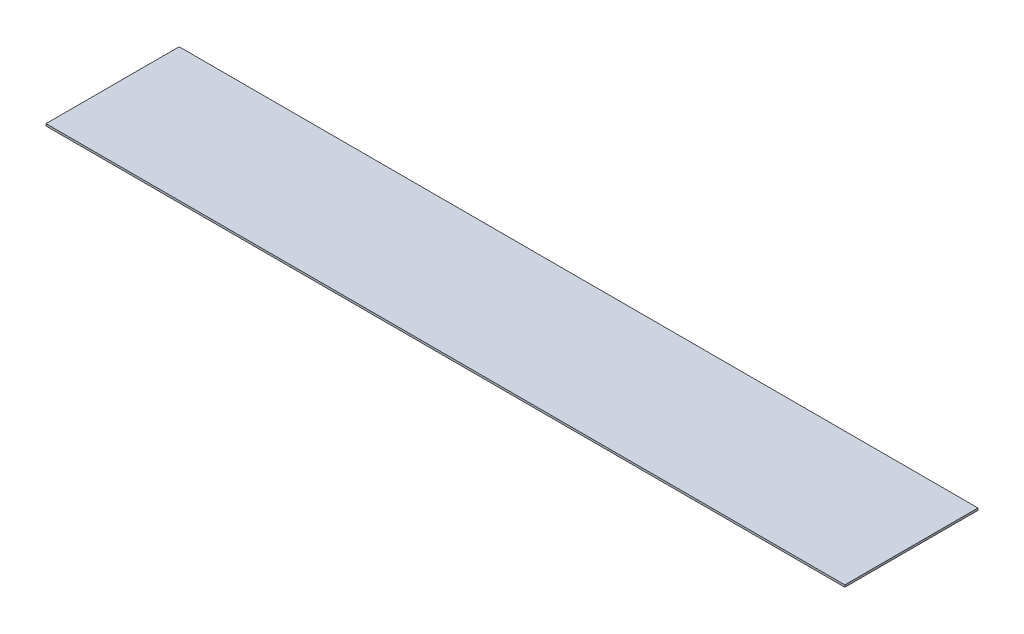
ISO-10303-21;
HEADER;
FILE_DESCRIPTION(('STEP AP214'),'2;1');
FILE_NAME('part.step','',(''),(''),'','','');
FILE_SCHEMA(('AUTOMOTIVE_DESIGN { 1 0 10303 214 1 1 1 1 }'));
ENDSEC;
DATA;
#1=APPLICATION_CONTEXT('core data for automotive mechanical design processes');
#2=APPLICATION_PROTOCOL_DEFINITION('international standard','automotive_design',2000,#1);
#3=PRODUCT_CONTEXT('',#1,'mechanical');
#4=PRODUCT('Part','Part','',(#3));
#5=PRODUCT_RELATED_PRODUCT_CATEGORY('part','',(#4));
#6=PRODUCT_DEFINITION_FORMATION('','',#4);
#7=PRODUCT_DEFINITION_CONTEXT('part definition',#1,'design');
#8=PRODUCT_DEFINITION('design','',#6,#7);
#9=PRODUCT_DEFINITION_SHAPE('','',#8);
#10=(LENGTH_UNIT() NAMED_UNIT(*) SI_UNIT(.MILLI.,.METRE.));
#11=(NAMED_UNIT(*) PLANE_ANGLE_UNIT() SI_UNIT($,.RADIAN.));
#12=(NAMED_UNIT(*) SI_UNIT($,.STERADIAN.) SOLID_ANGLE_UNIT());
#13=UNCERTAINTY_MEASURE_WITH_UNIT(LENGTH_MEASURE(1.E-05),#10,'distance_accuracy_value','');
#14=(GEOMETRIC_REPRESENTATION_CONTEXT(3) GLOBAL_UNCERTAINTY_ASSIGNED_CONTEXT((#13)) GLOBAL_UNIT_ASSIGNED_CONTEXT((#10,
#11,#12)) REPRESENTATION_CONTEXT('',''));
#15=CARTESIAN_POINT('',(0.,0.,0.));
#16=DIRECTION('',(0.,0.,1.));
#17=DIRECTION('',(1.,0.,0.));
#18=AXIS2_PLACEMENT_3D('',#15,#16,#17);
#19=CARTESIAN_POINT('',(0.,-81.849866020411,0.));
#20=DIRECTION('',(1.,0.,0.));
#21=DIRECTION('',(0.,0.,-1.));
#22=AXIS2_PLACEMENT_3D('',#19,#20,#21);
#23=PLANE('',#22);
#24=DIRECTION('',(0.,0.,-1.));
#25=VECTOR('',#24,1.);
#26=CARTESIAN_POINT('',(0.,-80.262366020411,0.));
#27=LINE('',#26,#25);
#28=CARTESIAN_POINT('',(0.,-80.262366020411,101.6));
#29=VERTEX_POINT('',#28);
#30=CARTESIAN_POINT('',(0.,-80.262366020411,0.));
#31=VERTEX_POINT('',#30);
#32=EDGE_CURVE('E99',#29,#31,#27,.T.);
#33=ORIENTED_EDGE('',*,*,#32,.T.);
#34=DIRECTION('',(0.,1.,0.));
#35=VECTOR('',#34,1.);
#36=CARTESIAN_POINT('',(0.,-81.849866020411,0.));
#37=LINE('',#36,#35);
#38=CARTESIAN_POINT('',(0.,-81.849866020411,0.));
#39=VERTEX_POINT('',#38);
#40=EDGE_CURVE('E11',#39,#31,#37,.T.);
#41=ORIENTED_EDGE('',*,*,#40,.F.);
#42=DIRECTION('',(0.,0.,-1.));
#43=VECTOR('',#42,1.);
#44=CARTESIAN_POINT('',(0.,-81.849866020411,0.));
#45=LINE('',#44,#43);
#46=CARTESIAN_POINT('',(0.,-81.849866020411,101.6));
#47=VERTEX_POINT('',#46);
#48=EDGE_CURVE('E87',#47,#39,#45,.T.);
#49=ORIENTED_EDGE('',*,*,#48,.F.);
#50=DIRECTION('',(0.,1.,0.));
#51=VECTOR('',#50,1.);
#52=CARTESIAN_POINT('',(0.,-81.849866020411,101.6));
#53=LINE('',#52,#51);
#54=EDGE_CURVE('E95',#47,#29,#53,.T.);
#55=ORIENTED_EDGE('',*,*,#54,.T.);
#56=EDGE_LOOP('',(#33,#41,#49,#55));
#57=FACE_BOUND('',#56,.T.);
#58=ADVANCED_FACE('F36',(#57),#23,.F.);
#59=CARTESIAN_POINT('',(0.,-81.849866020411,0.));
#60=DIRECTION('',(0.,0.,1.));
#61=DIRECTION('',(1.,0.,0.));
#62=AXIS2_PLACEMENT_3D('',#59,#60,#61);
#63=PLANE('',#62);
#64=DIRECTION('',(1.,0.,0.));
#65=VECTOR('',#64,1.);
#66=CARTESIAN_POINT('',(0.,-80.262366020411,0.));
#67=LINE('',#66,#65);
#68=CARTESIAN_POINT('',(609.6,-80.262366020411,0.));
#69=VERTEX_POINT('',#68);
#70=EDGE_CURVE('E91',#31,#69,#67,.T.);
#71=ORIENTED_EDGE('',*,*,#70,.T.);
#72=DIRECTION('',(0.,1.,0.));
#73=VECTOR('',#72,1.);
#74=CARTESIAN_POINT('',(609.6,-81.849866020411,0.));
#75=LINE('',#74,#73);
#76=CARTESIAN_POINT('',(609.6,-81.849866020411,0.));
#77=VERTEX_POINT('',#76);
#78=EDGE_CURVE('E44',#77,#69,#75,.T.);
#79=ORIENTED_EDGE('',*,*,#78,.F.);
#80=DIRECTION('',(1.,0.,0.));
#81=VECTOR('',#80,1.);
#82=CARTESIAN_POINT('',(0.,-81.849866020411,0.));
#83=LINE('',#82,#81);
#84=EDGE_CURVE('E82',#39,#77,#83,.T.);
#85=ORIENTED_EDGE('',*,*,#84,.F.);
#86=ORIENTED_EDGE('',*,*,#40,.T.);
#87=EDGE_LOOP('',(#71,#79,#85,#86));
#88=FACE_BOUND('',#87,.T.);
#89=ADVANCED_FACE('F90',(#88),#63,.F.);
#90=CARTESIAN_POINT('',(609.6,-81.849866020411,0.));
#91=DIRECTION('',(-1.,0.,0.));
#92=DIRECTION('',(0.,0.,1.));
#93=AXIS2_PLACEMENT_3D('',#90,#91,#92);
#94=PLANE('',#93);
#95=DIRECTION('',(0.,0.,1.));
#96=VECTOR('',#95,1.);
#97=CARTESIAN_POINT('',(609.6,-80.262366020411,0.));
#98=LINE('',#97,#96);
#99=CARTESIAN_POINT('',(609.6,-80.262366020411,101.6));
#100=VERTEX_POINT('',#99);
#101=EDGE_CURVE('E69',#69,#100,#98,.T.);
#102=ORIENTED_EDGE('',*,*,#101,.T.);
#103=DIRECTION('',(0.,1.,0.));
#104=VECTOR('',#103,1.);
#105=CARTESIAN_POINT('',(609.6,-81.849866020411,101.6));
#106=LINE('',#105,#104);
#107=CARTESIAN_POINT('',(609.6,-81.849866020411,101.6));
#108=VERTEX_POINT('',#107);
#109=EDGE_CURVE('E92',#108,#100,#106,.T.);
#110=ORIENTED_EDGE('',*,*,#109,.F.);
#111=DIRECTION('',(0.,0.,1.));
#112=VECTOR('',#111,1.);
#113=CARTESIAN_POINT('',(609.6,-81.849866020411,0.));
#114=LINE('',#113,#112);
#115=EDGE_CURVE('E85',#77,#108,#114,.T.);
#116=ORIENTED_EDGE('',*,*,#115,.F.);
#117=ORIENTED_EDGE('',*,*,#78,.T.);
#118=EDGE_LOOP('',(#102,#110,#116,#117));
#119=FACE_BOUND('',#118,.T.);
#120=ADVANCED_FACE('F93',(#119),#94,.F.);
#121=CARTESIAN_POINT('',(0.,-81.849866020411,101.6));
#122=DIRECTION('',(0.,0.,-1.));
#123=DIRECTION('',(-1.,0.,0.));
#124=AXIS2_PLACEMENT_3D('',#121,#122,#123);
#125=PLANE('',#124);
#126=DIRECTION('',(-1.,0.,0.));
#127=VECTOR('',#126,1.);
#128=CARTESIAN_POINT('',(0.,-80.262366020411,101.6));
#129=LINE('',#128,#127);
#130=EDGE_CURVE('E75',#100,#29,#129,.T.);
#131=ORIENTED_EDGE('',*,*,#130,.T.);
#132=ORIENTED_EDGE('',*,*,#54,.F.);
#133=DIRECTION('',(-1.,0.,0.));
#134=VECTOR('',#133,1.);
#135=CARTESIAN_POINT('',(0.,-81.849866020411,101.6));
#136=LINE('',#135,#134);
#137=EDGE_CURVE('E52',#108,#47,#136,.T.);
#138=ORIENTED_EDGE('',*,*,#137,.F.);
#139=ORIENTED_EDGE('',*,*,#109,.T.);
#140=EDGE_LOOP('',(#131,#132,#138,#139));
#141=FACE_BOUND('',#140,.T.);
#142=ADVANCED_FACE('F106',(#141),#125,.F.);
#143=CARTESIAN_POINT('',(0.,-81.849866020411,0.));
#144=DIRECTION('',(0.,1.,0.));
#145=DIRECTION('',(0.,0.,1.));
#146=AXIS2_PLACEMENT_3D('',#143,#144,#145);
#147=PLANE('',#146);
#148=ORIENTED_EDGE('',*,*,#48,.T.);
#149=ORIENTED_EDGE('',*,*,#84,.T.);
#150=ORIENTED_EDGE('',*,*,#115,.T.);
#151=ORIENTED_EDGE('',*,*,#137,.T.);
#152=EDGE_LOOP('',(#148,#149,#150,#151));
#153=FACE_BOUND('',#152,.T.);
#154=ADVANCED_FACE('F83',(#153),#147,.F.);
#155=CARTESIAN_POINT('',(0.,-80.262366020411,0.));
#156=DIRECTION('',(0.,1.,0.));
#157=DIRECTION('',(0.,0.,1.));
#158=AXIS2_PLACEMENT_3D('',#155,#156,#157);
#159=PLANE('',#158);
#160=ORIENTED_EDGE('',*,*,#32,.F.);
#161=ORIENTED_EDGE('',*,*,#130,.F.);
#162=ORIENTED_EDGE('',*,*,#101,.F.);
#163=ORIENTED_EDGE('',*,*,#70,.F.);
#164=EDGE_LOOP('',(#160,#161,#162,#163));
#165=FACE_BOUND('',#164,.T.);
#166=ADVANCED_FACE('F109',(#165),#159,.T.);
#167=CLOSED_SHELL('',(#58,#89,#120,#142,#154,#166));
#168=MANIFOLD_SOLID_BREP('B2',#167);
#169=ADVANCED_BREP_SHAPE_REPRESENTATION('',(#18,#168),#14);
#170=SHAPE_DEFINITION_REPRESENTATION(#9,#169);
ENDSEC;
END-ISO-10303-21;
